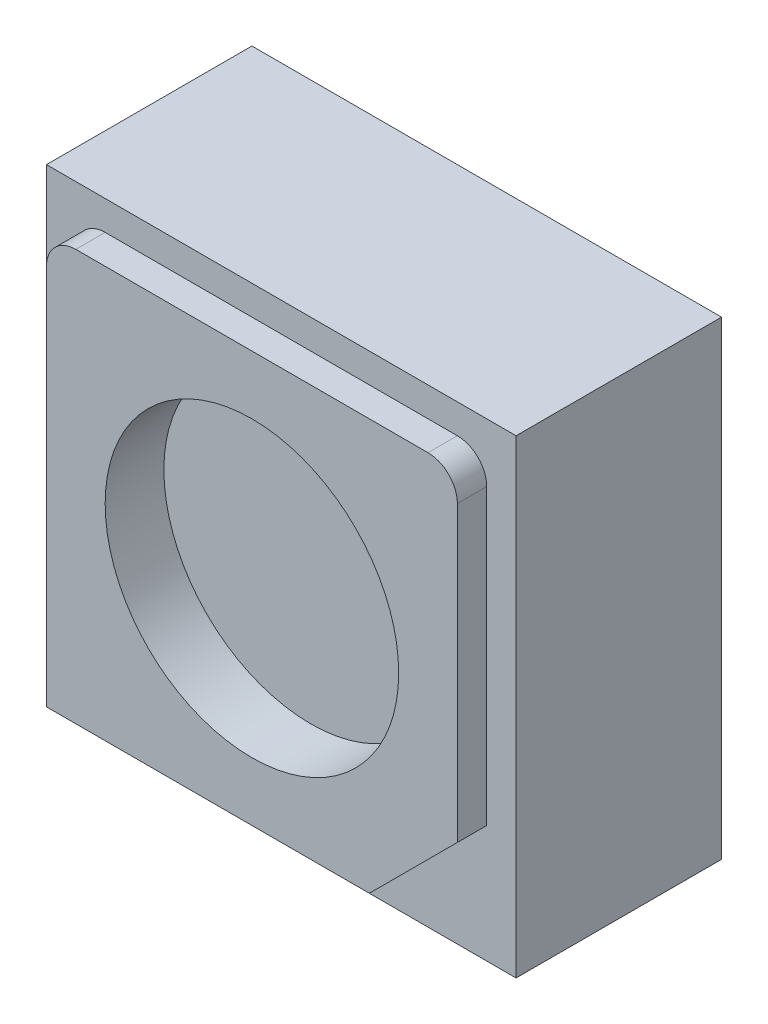
ISO-10303-21;
HEADER;
FILE_DESCRIPTION(('STEP AP214'),'2;1');
FILE_NAME('part.step','',(''),(''),'','','');
FILE_SCHEMA(('AUTOMOTIVE_DESIGN { 1 0 10303 214 1 1 1 1 }'));
ENDSEC;
DATA;
#1=APPLICATION_CONTEXT('core data for automotive mechanical design processes');
#2=APPLICATION_PROTOCOL_DEFINITION('international standard','automotive_design',2000,#1);
#3=PRODUCT_CONTEXT('',#1,'mechanical');
#4=PRODUCT('Part','Part','',(#3));
#5=PRODUCT_RELATED_PRODUCT_CATEGORY('part','',(#4));
#6=PRODUCT_DEFINITION_FORMATION('','',#4);
#7=PRODUCT_DEFINITION_CONTEXT('part definition',#1,'design');
#8=PRODUCT_DEFINITION('design','',#6,#7);
#9=PRODUCT_DEFINITION_SHAPE('','',#8);
#10=(LENGTH_UNIT() NAMED_UNIT(*) SI_UNIT(.MILLI.,.METRE.));
#11=(NAMED_UNIT(*) PLANE_ANGLE_UNIT() SI_UNIT($,.RADIAN.));
#12=(NAMED_UNIT(*) SI_UNIT($,.STERADIAN.) SOLID_ANGLE_UNIT());
#13=UNCERTAINTY_MEASURE_WITH_UNIT(LENGTH_MEASURE(1.E-05),#10,'distance_accuracy_value','');
#14=(GEOMETRIC_REPRESENTATION_CONTEXT(3) GLOBAL_UNCERTAINTY_ASSIGNED_CONTEXT((#13)) GLOBAL_UNIT_ASSIGNED_CONTEXT((#10,
#11,#12)) REPRESENTATION_CONTEXT('',''));
#15=CARTESIAN_POINT('',(0.,0.,0.));
#16=DIRECTION('',(0.,0.,1.));
#17=DIRECTION('',(1.,0.,0.));
#18=AXIS2_PLACEMENT_3D('',#15,#16,#17);
#19=CARTESIAN_POINT('',(0.,0.,35.));
#20=DIRECTION('',(0.,0.,-1.));
#21=DIRECTION('',(-1.,0.,0.));
#22=AXIS2_PLACEMENT_3D('',#19,#20,#21);
#23=PLANE('',#22);
#24=DIRECTION('',(0.,-1.,0.));
#25=VECTOR('',#24,1.);
#26=CARTESIAN_POINT('',(0.,0.,35.));
#27=LINE('',#26,#25);
#28=CARTESIAN_POINT('',(0.,80.,35.));
#29=VERTEX_POINT('',#28);
#30=CARTESIAN_POINT('',(0.,0.,35.));
#31=VERTEX_POINT('',#30);
#32=EDGE_CURVE('E145',#29,#31,#27,.T.);
#33=ORIENTED_EDGE('',*,*,#32,.T.);
#34=DIRECTION('',(1.,0.,0.));
#35=VECTOR('',#34,1.);
#36=CARTESIAN_POINT('',(0.,0.,35.));
#37=LINE('',#36,#35);
#38=CARTESIAN_POINT('',(80.,0.,35.));
#39=VERTEX_POINT('',#38);
#40=EDGE_CURVE('E148',#31,#39,#37,.T.);
#41=ORIENTED_EDGE('',*,*,#40,.T.);
#42=DIRECTION('',(0.,1.,0.));
#43=VECTOR('',#42,1.);
#44=CARTESIAN_POINT('',(80.,0.,35.));
#45=LINE('',#44,#43);
#46=CARTESIAN_POINT('',(80.,80.,35.));
#47=VERTEX_POINT('',#46);
#48=EDGE_CURVE('E151',#39,#47,#45,.T.);
#49=ORIENTED_EDGE('',*,*,#48,.T.);
#50=DIRECTION('',(-1.,0.,0.));
#51=VECTOR('',#50,1.);
#52=CARTESIAN_POINT('',(0.,80.,35.));
#53=LINE('',#52,#51);
#54=EDGE_CURVE('E153',#47,#29,#53,.T.);
#55=ORIENTED_EDGE('',*,*,#54,.T.);
#56=EDGE_LOOP('',(#33,#41,#49,#55));
#57=FACE_BOUND('',#56,.T.);
#58=DIRECTION('',(0.,-1.,0.));
#59=VECTOR('',#58,1.);
#60=CARTESIAN_POINT('',(5.,4.99999999999999,35.));
#61=LINE('',#60,#59);
#62=CARTESIAN_POINT('',(5.,70.,35.));
#63=VERTEX_POINT('',#62);
#64=CARTESIAN_POINT('',(5.,4.99999999999999,35.));
#65=VERTEX_POINT('',#64);
#66=EDGE_CURVE('E48',#63,#65,#61,.T.);
#67=ORIENTED_EDGE('',*,*,#66,.F.);
#68=CARTESIAN_POINT('',(10.,70.,35.));
#69=DIRECTION('',(0.,0.,1.));
#70=DIRECTION('',(-1.,0.,0.));
#71=AXIS2_PLACEMENT_3D('',#68,#69,#70);
#72=CIRCLE('',#71,5.);
#73=CARTESIAN_POINT('',(10.,75.,35.));
#74=VERTEX_POINT('',#73);
#75=EDGE_CURVE('E52',#74,#63,#72,.T.);
#76=ORIENTED_EDGE('',*,*,#75,.F.);
#77=DIRECTION('',(-1.,0.,0.));
#78=VECTOR('',#77,1.);
#79=CARTESIAN_POINT('',(10.,75.,35.));
#80=LINE('',#79,#78);
#81=CARTESIAN_POINT('',(70.,75.,35.));
#82=VERTEX_POINT('',#81);
#83=EDGE_CURVE('E355',#82,#74,#80,.T.);
#84=ORIENTED_EDGE('',*,*,#83,.F.);
#85=CARTESIAN_POINT('',(70.,70.,35.));
#86=DIRECTION('',(0.,0.,1.));
#87=DIRECTION('',(-1.,0.,0.));
#88=AXIS2_PLACEMENT_3D('',#85,#86,#87);
#89=CIRCLE('',#88,5.00000000000001);
#90=CARTESIAN_POINT('',(75.,70.,35.));
#91=VERTEX_POINT('',#90);
#92=EDGE_CURVE('E352',#91,#82,#89,.T.);
#93=ORIENTED_EDGE('',*,*,#92,.F.);
#94=DIRECTION('',(0.,1.,0.));
#95=VECTOR('',#94,1.);
#96=CARTESIAN_POINT('',(75.,20.,35.));
#97=LINE('',#96,#95);
#98=CARTESIAN_POINT('',(75.,20.,35.));
#99=VERTEX_POINT('',#98);
#100=EDGE_CURVE('E349',#99,#91,#97,.T.);
#101=ORIENTED_EDGE('',*,*,#100,.F.);
#102=DIRECTION('',(0.707106781186548,0.707106781186547,0.));
#103=VECTOR('',#102,1.);
#104=CARTESIAN_POINT('',(60.,4.99999999999999,35.));
#105=LINE('',#104,#103);
#106=CARTESIAN_POINT('',(60.,4.99999999999999,35.));
#107=VERTEX_POINT('',#106);
#108=EDGE_CURVE('E346',#107,#99,#105,.T.);
#109=ORIENTED_EDGE('',*,*,#108,.F.);
#110=DIRECTION('',(1.,0.,0.));
#111=VECTOR('',#110,1.);
#112=CARTESIAN_POINT('',(5.,4.99999999999999,35.));
#113=LINE('',#112,#111);
#114=EDGE_CURVE('E331',#65,#107,#113,.T.);
#115=ORIENTED_EDGE('',*,*,#114,.F.);
#116=EDGE_LOOP('',(#67,#76,#84,#93,#101,#109,#115));
#117=FACE_BOUND('',#116,.T.);
#118=ADVANCED_FACE('F33',(#57,#117),#23,.F.);
#119=CARTESIAN_POINT('',(0.,0.,35.));
#120=DIRECTION('',(1.,0.,0.));
#121=DIRECTION('',(0.,0.,-1.));
#122=AXIS2_PLACEMENT_3D('',#119,#120,#121);
#123=PLANE('',#122);
#124=DIRECTION('',(0.,-1.,0.));
#125=VECTOR('',#124,1.);
#126=CARTESIAN_POINT('',(0.,0.,0.));
#127=LINE('',#126,#125);
#128=CARTESIAN_POINT('',(0.,80.,0.));
#129=VERTEX_POINT('',#128);
#130=CARTESIAN_POINT('',(0.,0.,0.));
#131=VERTEX_POINT('',#130);
#132=EDGE_CURVE('E136',#129,#131,#127,.T.);
#133=ORIENTED_EDGE('',*,*,#132,.T.);
#134=DIRECTION('',(0.,0.,-1.));
#135=VECTOR('',#134,1.);
#136=CARTESIAN_POINT('',(0.,0.,35.));
#137=LINE('',#136,#135);
#138=EDGE_CURVE('E11',#31,#131,#137,.T.);
#139=ORIENTED_EDGE('',*,*,#138,.F.);
#140=ORIENTED_EDGE('',*,*,#32,.F.);
#141=DIRECTION('',(0.,0.,-1.));
#142=VECTOR('',#141,1.);
#143=CARTESIAN_POINT('',(0.,80.,35.));
#144=LINE('',#143,#142);
#145=EDGE_CURVE('E154',#29,#129,#144,.T.);
#146=ORIENTED_EDGE('',*,*,#145,.T.);
#147=EDGE_LOOP('',(#133,#139,#140,#146));
#148=FACE_BOUND('',#147,.T.);
#149=ADVANCED_FACE('F35',(#148),#123,.F.);
#150=CARTESIAN_POINT('',(0.,0.,35.));
#151=DIRECTION('',(0.,1.,0.));
#152=DIRECTION('',(0.,0.,1.));
#153=AXIS2_PLACEMENT_3D('',#150,#151,#152);
#154=PLANE('',#153);
#155=DIRECTION('',(1.,0.,0.));
#156=VECTOR('',#155,1.);
#157=CARTESIAN_POINT('',(0.,0.,0.));
#158=LINE('',#157,#156);
#159=CARTESIAN_POINT('',(80.,0.,0.));
#160=VERTEX_POINT('',#159);
#161=EDGE_CURVE('E139',#131,#160,#158,.T.);
#162=ORIENTED_EDGE('',*,*,#161,.T.);
#163=DIRECTION('',(0.,0.,-1.));
#164=VECTOR('',#163,1.);
#165=CARTESIAN_POINT('',(80.,0.,35.));
#166=LINE('',#165,#164);
#167=EDGE_CURVE('E41',#39,#160,#166,.T.);
#168=ORIENTED_EDGE('',*,*,#167,.F.);
#169=ORIENTED_EDGE('',*,*,#40,.F.);
#170=ORIENTED_EDGE('',*,*,#138,.T.);
#171=EDGE_LOOP('',(#162,#168,#169,#170));
#172=FACE_BOUND('',#171,.T.);
#173=ADVANCED_FACE('F184',(#172),#154,.F.);
#174=CARTESIAN_POINT('',(80.,0.,35.));
#175=DIRECTION('',(-1.,0.,0.));
#176=DIRECTION('',(0.,0.,1.));
#177=AXIS2_PLACEMENT_3D('',#174,#175,#176);
#178=PLANE('',#177);
#179=DIRECTION('',(0.,1.,0.));
#180=VECTOR('',#179,1.);
#181=CARTESIAN_POINT('',(80.,0.,0.));
#182=LINE('',#181,#180);
#183=CARTESIAN_POINT('',(80.,80.,0.));
#184=VERTEX_POINT('',#183);
#185=EDGE_CURVE('E157',#160,#184,#182,.T.);
#186=ORIENTED_EDGE('',*,*,#185,.T.);
#187=DIRECTION('',(0.,0.,-1.));
#188=VECTOR('',#187,1.);
#189=CARTESIAN_POINT('',(80.,80.,35.));
#190=LINE('',#189,#188);
#191=EDGE_CURVE('E162',#47,#184,#190,.T.);
#192=ORIENTED_EDGE('',*,*,#191,.F.);
#193=ORIENTED_EDGE('',*,*,#48,.F.);
#194=ORIENTED_EDGE('',*,*,#167,.T.);
#195=EDGE_LOOP('',(#186,#192,#193,#194));
#196=FACE_BOUND('',#195,.T.);
#197=ADVANCED_FACE('F169',(#196),#178,.F.);
#198=CARTESIAN_POINT('',(0.,80.,35.));
#199=DIRECTION('',(0.,-1.,0.));
#200=DIRECTION('',(0.,0.,-1.));
#201=AXIS2_PLACEMENT_3D('',#198,#199,#200);
#202=PLANE('',#201);
#203=DIRECTION('',(-1.,0.,0.));
#204=VECTOR('',#203,1.);
#205=CARTESIAN_POINT('',(0.,80.,0.));
#206=LINE('',#205,#204);
#207=EDGE_CURVE('E149',#184,#129,#206,.T.);
#208=ORIENTED_EDGE('',*,*,#207,.T.);
#209=ORIENTED_EDGE('',*,*,#145,.F.);
#210=ORIENTED_EDGE('',*,*,#54,.F.);
#211=ORIENTED_EDGE('',*,*,#191,.T.);
#212=EDGE_LOOP('',(#208,#209,#210,#211));
#213=FACE_BOUND('',#212,.T.);
#214=ADVANCED_FACE('F178',(#213),#202,.F.);
#215=CARTESIAN_POINT('',(0.,0.,0.));
#216=DIRECTION('',(0.,0.,-1.));
#217=DIRECTION('',(-1.,0.,0.));
#218=AXIS2_PLACEMENT_3D('',#215,#216,#217);
#219=PLANE('',#218);
#220=ORIENTED_EDGE('',*,*,#132,.F.);
#221=ORIENTED_EDGE('',*,*,#207,.F.);
#222=ORIENTED_EDGE('',*,*,#185,.F.);
#223=ORIENTED_EDGE('',*,*,#161,.F.);
#224=EDGE_LOOP('',(#220,#221,#222,#223));
#225=FACE_BOUND('',#224,.T.);
#226=ADVANCED_FACE('F175',(#225),#219,.T.);
#227=CARTESIAN_POINT('',(5.,4.99999999999999,40.));
#228=DIRECTION('',(1.,0.,0.));
#229=DIRECTION('',(0.,1.,0.));
#230=AXIS2_PLACEMENT_3D('',#227,#228,#229);
#231=PLANE('',#230);
#232=ORIENTED_EDGE('',*,*,#66,.T.);
#233=DIRECTION('',(0.,0.,-1.));
#234=VECTOR('',#233,1.);
#235=CARTESIAN_POINT('',(5.,4.99999999999999,40.));
#236=LINE('',#235,#234);
#237=CARTESIAN_POINT('',(5.,4.99999999999999,40.));
#238=VERTEX_POINT('',#237);
#239=EDGE_CURVE('E119',#238,#65,#236,.T.);
#240=ORIENTED_EDGE('',*,*,#239,.F.);
#241=DIRECTION('',(0.,-1.,0.));
#242=VECTOR('',#241,1.);
#243=CARTESIAN_POINT('',(5.,4.99999999999999,40.));
#244=LINE('',#243,#242);
#245=CARTESIAN_POINT('',(5.,70.,40.));
#246=VERTEX_POINT('',#245);
#247=EDGE_CURVE('E125',#246,#238,#244,.T.);
#248=ORIENTED_EDGE('',*,*,#247,.F.);
#249=DIRECTION('',(0.,0.,-1.));
#250=VECTOR('',#249,1.);
#251=CARTESIAN_POINT('',(5.,70.,40.));
#252=LINE('',#251,#250);
#253=EDGE_CURVE('E343',#246,#63,#252,.T.);
#254=ORIENTED_EDGE('',*,*,#253,.T.);
#255=EDGE_LOOP('',(#232,#240,#248,#254));
#256=FACE_BOUND('',#255,.T.);
#257=ADVANCED_FACE('F135',(#256),#231,.F.);
#258=CARTESIAN_POINT('',(5.,4.99999999999999,40.));
#259=DIRECTION('',(0.,1.,0.));
#260=DIRECTION('',(0.,0.,1.));
#261=AXIS2_PLACEMENT_3D('',#258,#259,#260);
#262=PLANE('',#261);
#263=ORIENTED_EDGE('',*,*,#114,.T.);
#264=DIRECTION('',(0.,0.,-1.));
#265=VECTOR('',#264,1.);
#266=CARTESIAN_POINT('',(60.,4.99999999999999,40.));
#267=LINE('',#266,#265);
#268=CARTESIAN_POINT('',(60.,4.99999999999999,40.));
#269=VERTEX_POINT('',#268);
#270=EDGE_CURVE('E121',#269,#107,#267,.T.);
#271=ORIENTED_EDGE('',*,*,#270,.F.);
#272=DIRECTION('',(1.,0.,0.));
#273=VECTOR('',#272,1.);
#274=CARTESIAN_POINT('',(5.,4.99999999999999,40.));
#275=LINE('',#274,#273);
#276=EDGE_CURVE('E114',#238,#269,#275,.T.);
#277=ORIENTED_EDGE('',*,*,#276,.F.);
#278=ORIENTED_EDGE('',*,*,#239,.T.);
#279=EDGE_LOOP('',(#263,#271,#277,#278));
#280=FACE_BOUND('',#279,.T.);
#281=ADVANCED_FACE('F117',(#280),#262,.F.);
#282=CARTESIAN_POINT('',(60.,4.99999999999999,40.));
#283=DIRECTION('',(-0.707106781186547,0.707106781186548,0.));
#284=DIRECTION('',(-0.707106781186548,-0.707106781186547,0.));
#285=AXIS2_PLACEMENT_3D('',#282,#283,#284);
#286=PLANE('',#285);
#287=ORIENTED_EDGE('',*,*,#108,.T.);
#288=DIRECTION('',(0.,0.,-1.));
#289=VECTOR('',#288,1.);
#290=CARTESIAN_POINT('',(75.,20.,40.));
#291=LINE('',#290,#289);
#292=CARTESIAN_POINT('',(75.,20.,40.));
#293=VERTEX_POINT('',#292);
#294=EDGE_CURVE('E141',#293,#99,#291,.T.);
#295=ORIENTED_EDGE('',*,*,#294,.F.);
#296=DIRECTION('',(0.707106781186548,0.707106781186547,0.));
#297=VECTOR('',#296,1.);
#298=CARTESIAN_POINT('',(60.,4.99999999999999,40.));
#299=LINE('',#298,#297);
#300=EDGE_CURVE('E124',#269,#293,#299,.T.);
#301=ORIENTED_EDGE('',*,*,#300,.F.);
#302=ORIENTED_EDGE('',*,*,#270,.T.);
#303=EDGE_LOOP('',(#287,#295,#301,#302));
#304=FACE_BOUND('',#303,.T.);
#305=ADVANCED_FACE('F220',(#304),#286,.F.);
#306=CARTESIAN_POINT('',(75.,20.,40.));
#307=DIRECTION('',(-1.,0.,0.));
#308=DIRECTION('',(0.,0.,1.));
#309=AXIS2_PLACEMENT_3D('',#306,#307,#308);
#310=PLANE('',#309);
#311=ORIENTED_EDGE('',*,*,#100,.T.);
#312=DIRECTION('',(0.,0.,-1.));
#313=VECTOR('',#312,1.);
#314=CARTESIAN_POINT('',(75.,70.,40.));
#315=LINE('',#314,#313);
#316=CARTESIAN_POINT('',(75.,70.,40.));
#317=VERTEX_POINT('',#316);
#318=EDGE_CURVE('E365',#317,#91,#315,.T.);
#319=ORIENTED_EDGE('',*,*,#318,.F.);
#320=DIRECTION('',(0.,1.,0.));
#321=VECTOR('',#320,1.);
#322=CARTESIAN_POINT('',(75.,20.,40.));
#323=LINE('',#322,#321);
#324=EDGE_CURVE('E337',#293,#317,#323,.T.);
#325=ORIENTED_EDGE('',*,*,#324,.F.);
#326=ORIENTED_EDGE('',*,*,#294,.T.);
#327=EDGE_LOOP('',(#311,#319,#325,#326));
#328=FACE_BOUND('',#327,.T.);
#329=ADVANCED_FACE('F226',(#328),#310,.F.);
#330=CARTESIAN_POINT('',(70.,70.,40.));
#331=DIRECTION('',(0.,0.,-1.));
#332=DIRECTION('',(-1.,0.,0.));
#333=AXIS2_PLACEMENT_3D('',#330,#331,#332);
#334=CYLINDRICAL_SURFACE('',#333,5.00000000000001);
#335=ORIENTED_EDGE('',*,*,#92,.T.);
#336=DIRECTION('',(0.,0.,-1.));
#337=VECTOR('',#336,1.);
#338=CARTESIAN_POINT('',(70.,75.,40.));
#339=LINE('',#338,#337);
#340=CARTESIAN_POINT('',(70.,75.,40.));
#341=VERTEX_POINT('',#340);
#342=EDGE_CURVE('E362',#341,#82,#339,.T.);
#343=ORIENTED_EDGE('',*,*,#342,.F.);
#344=CARTESIAN_POINT('',(70.,70.,40.));
#345=DIRECTION('',(0.,0.,1.));
#346=DIRECTION('',(-1.,0.,0.));
#347=AXIS2_PLACEMENT_3D('',#344,#345,#346);
#348=CIRCLE('',#347,5.00000000000001);
#349=EDGE_CURVE('E339',#317,#341,#348,.T.);
#350=ORIENTED_EDGE('',*,*,#349,.F.);
#351=ORIENTED_EDGE('',*,*,#318,.T.);
#352=EDGE_LOOP('',(#335,#343,#350,#351));
#353=FACE_BOUND('',#352,.T.);
#354=ADVANCED_FACE('F234',(#353),#334,.T.);
#355=CARTESIAN_POINT('',(10.,75.,40.));
#356=DIRECTION('',(0.,-1.,0.));
#357=DIRECTION('',(0.,0.,-1.));
#358=AXIS2_PLACEMENT_3D('',#355,#356,#357);
#359=PLANE('',#358);
#360=ORIENTED_EDGE('',*,*,#83,.T.);
#361=DIRECTION('',(0.,0.,-1.));
#362=VECTOR('',#361,1.);
#363=CARTESIAN_POINT('',(10.,75.,40.));
#364=LINE('',#363,#362);
#365=CARTESIAN_POINT('',(10.,75.,40.));
#366=VERTEX_POINT('',#365);
#367=EDGE_CURVE('E359',#366,#74,#364,.T.);
#368=ORIENTED_EDGE('',*,*,#367,.F.);
#369=DIRECTION('',(-1.,0.,0.));
#370=VECTOR('',#369,1.);
#371=CARTESIAN_POINT('',(10.,75.,40.));
#372=LINE('',#371,#370);
#373=EDGE_CURVE('E341',#341,#366,#372,.T.);
#374=ORIENTED_EDGE('',*,*,#373,.F.);
#375=ORIENTED_EDGE('',*,*,#342,.T.);
#376=EDGE_LOOP('',(#360,#368,#374,#375));
#377=FACE_BOUND('',#376,.T.);
#378=ADVANCED_FACE('F242',(#377),#359,.F.);
#379=CARTESIAN_POINT('',(10.,70.,40.));
#380=DIRECTION('',(0.,0.,-1.));
#381=DIRECTION('',(-1.,0.,0.));
#382=AXIS2_PLACEMENT_3D('',#379,#380,#381);
#383=CYLINDRICAL_SURFACE('',#382,5.);
#384=ORIENTED_EDGE('',*,*,#75,.T.);
#385=ORIENTED_EDGE('',*,*,#253,.F.);
#386=CARTESIAN_POINT('',(10.,70.,40.));
#387=DIRECTION('',(0.,0.,1.));
#388=DIRECTION('',(-1.,0.,0.));
#389=AXIS2_PLACEMENT_3D('',#386,#387,#388);
#390=CIRCLE('',#389,5.);
#391=EDGE_CURVE('E130',#366,#246,#390,.T.);
#392=ORIENTED_EDGE('',*,*,#391,.F.);
#393=ORIENTED_EDGE('',*,*,#367,.T.);
#394=EDGE_LOOP('',(#384,#385,#392,#393));
#395=FACE_BOUND('',#394,.T.);
#396=ADVANCED_FACE('F250',(#395),#383,.T.);
#397=CARTESIAN_POINT('',(10.,70.,40.));
#398=DIRECTION('',(0.,0.,-1.));
#399=DIRECTION('',(-1.,0.,0.));
#400=AXIS2_PLACEMENT_3D('',#397,#398,#399);
#401=PLANE('',#400);
#402=CARTESIAN_POINT('',(40.,40.,40.));
#403=DIRECTION('',(0.,0.,1.));
#404=DIRECTION('',(1.,0.,0.));
#405=AXIS2_PLACEMENT_3D('',#402,#403,#404);
#406=CIRCLE('',#405,25.);
#407=CARTESIAN_POINT('',(65.,40.,40.));
#408=VERTEX_POINT('',#407);
#409=EDGE_CURVE('E329',#408,#408,#406,.T.);
#410=ORIENTED_EDGE('',*,*,#409,.F.);
#411=EDGE_LOOP('',(#410));
#412=FACE_BOUND('',#411,.T.);
#413=ORIENTED_EDGE('',*,*,#247,.T.);
#414=ORIENTED_EDGE('',*,*,#276,.T.);
#415=ORIENTED_EDGE('',*,*,#300,.T.);
#416=ORIENTED_EDGE('',*,*,#324,.T.);
#417=ORIENTED_EDGE('',*,*,#349,.T.);
#418=ORIENTED_EDGE('',*,*,#373,.T.);
#419=ORIENTED_EDGE('',*,*,#391,.T.);
#420=EDGE_LOOP('',(#413,#414,#415,#416,#417,#418,#419));
#421=FACE_BOUND('',#420,.T.);
#422=ADVANCED_FACE('F128',(#412,#421),#401,.F.);
#423=CARTESIAN_POINT('',(40.,40.,30.));
#424=DIRECTION('',(0.,0.,1.));
#425=DIRECTION('',(1.,0.,0.));
#426=AXIS2_PLACEMENT_3D('',#423,#424,#425);
#427=CYLINDRICAL_SURFACE('',#426,25.);
#428=CARTESIAN_POINT('',(40.,40.,30.));
#429=DIRECTION('',(0.,0.,1.));
#430=DIRECTION('',(1.,0.,0.));
#431=AXIS2_PLACEMENT_3D('',#428,#429,#430);
#432=CIRCLE('',#431,25.);
#433=CARTESIAN_POINT('',(65.,40.,30.));
#434=VERTEX_POINT('',#433);
#435=EDGE_CURVE('E328',#434,#434,#432,.T.);
#436=ORIENTED_EDGE('',*,*,#435,.F.);
#437=EDGE_LOOP('',(#436));
#438=FACE_BOUND('',#437,.T.);
#439=ORIENTED_EDGE('',*,*,#409,.T.);
#440=EDGE_LOOP('',(#439));
#441=FACE_BOUND('',#440,.T.);
#442=ADVANCED_FACE('F265',(#438,#441),#427,.F.);
#443=CARTESIAN_POINT('',(40.,40.,30.));
#444=DIRECTION('',(0.,0.,1.));
#445=DIRECTION('',(1.,0.,0.));
#446=AXIS2_PLACEMENT_3D('',#443,#444,#445);
#447=PLANE('',#446);
#448=ORIENTED_EDGE('',*,*,#435,.T.);
#449=EDGE_LOOP('',(#448));
#450=FACE_BOUND('',#449,.T.);
#451=ADVANCED_FACE('F273',(#450),#447,.T.);
#452=CLOSED_SHELL('',(#118,#149,#173,#197,#214,#226,#257,#281,#305,#329,#354,#378,#396,#422,
#442,#451));
#453=MANIFOLD_SOLID_BREP('B2',#452);
#454=ADVANCED_BREP_SHAPE_REPRESENTATION('',(#18,#453),#14);
#455=SHAPE_DEFINITION_REPRESENTATION(#9,#454);
ENDSEC;
END-ISO-10303-21;
